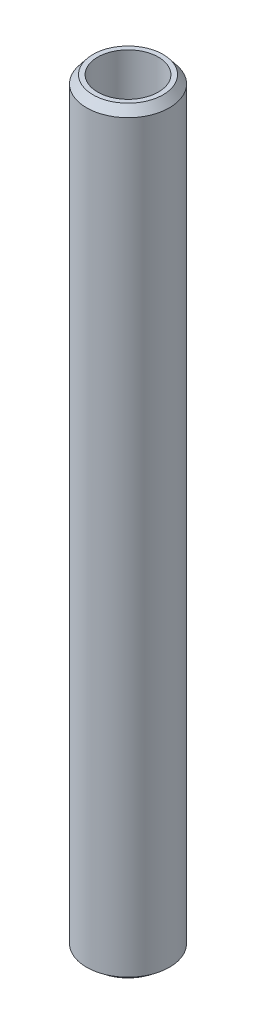
ISO-10303-21;
HEADER;
FILE_DESCRIPTION(('STEP AP214'),'2;1');
FILE_NAME('part.step','',(''),(''),'','','');
FILE_SCHEMA(('AUTOMOTIVE_DESIGN { 1 0 10303 214 1 1 1 1 }'));
ENDSEC;
DATA;
#1=APPLICATION_CONTEXT('core data for automotive mechanical design processes');
#2=APPLICATION_PROTOCOL_DEFINITION('international standard','automotive_design',2000,#1);
#3=PRODUCT_CONTEXT('',#1,'mechanical');
#4=PRODUCT('Part','Part','',(#3));
#5=PRODUCT_RELATED_PRODUCT_CATEGORY('part','',(#4));
#6=PRODUCT_DEFINITION_FORMATION('','',#4);
#7=PRODUCT_DEFINITION_CONTEXT('part definition',#1,'design');
#8=PRODUCT_DEFINITION('design','',#6,#7);
#9=PRODUCT_DEFINITION_SHAPE('','',#8);
#10=(LENGTH_UNIT() NAMED_UNIT(*) SI_UNIT(.MILLI.,.METRE.));
#11=(NAMED_UNIT(*) PLANE_ANGLE_UNIT() SI_UNIT($,.RADIAN.));
#12=(NAMED_UNIT(*) SI_UNIT($,.STERADIAN.) SOLID_ANGLE_UNIT());
#13=UNCERTAINTY_MEASURE_WITH_UNIT(LENGTH_MEASURE(1.E-05),#10,'distance_accuracy_value','');
#14=(GEOMETRIC_REPRESENTATION_CONTEXT(3) GLOBAL_UNCERTAINTY_ASSIGNED_CONTEXT((#13)) GLOBAL_UNIT_ASSIGNED_CONTEXT((#10,
#11,#12)) REPRESENTATION_CONTEXT('',''));
#15=CARTESIAN_POINT('',(0.,0.,0.));
#16=DIRECTION('',(0.,0.,1.));
#17=DIRECTION('',(1.,0.,0.));
#18=AXIS2_PLACEMENT_3D('',#15,#16,#17);
#19=CARTESIAN_POINT('',(0.,366.321487047811,0.));
#20=DIRECTION('',(0.,-1.,0.));
#21=DIRECTION('',(0.,0.,-1.));
#22=AXIS2_PLACEMENT_3D('',#19,#20,#21);
#23=CYLINDRICAL_SURFACE('',#22,20.);
#24=CARTESIAN_POINT('',(0.,362.430279607702,0.));
#25=DIRECTION('',(0.,1.,0.));
#26=DIRECTION('',(0.,0.,1.));
#27=AXIS2_PLACEMENT_3D('',#24,#25,#26);
#28=CIRCLE('',#27,20.);
#29=CARTESIAN_POINT('',(0.,362.430279607702,-20.));
#30=VERTEX_POINT('',#29);
#31=EDGE_CURVE('E50',#30,#30,#28,.F.);
#32=CARTESIAN_POINT('',(0.,3.08104572929319,0.));
#33=DIRECTION('',(0.,1.,0.));
#34=DIRECTION('',(0.,0.,1.));
#35=AXIS2_PLACEMENT_3D('',#32,#33,#34);
#36=CIRCLE('',#35,20.);
#37=CARTESIAN_POINT('',(0.,3.08104572929313,-20.));
#38=VERTEX_POINT('',#37);
#39=EDGE_CURVE('E51',#38,#38,#36,.T.);
#40=CARTESIAN_POINT('',(0.,362.430279607702,-20.));
#41=CARTESIAN_POINT('',(0.,358.687058421469,-20.));
#42=CARTESIAN_POINT('',(0.,354.943837235235,-20.));
#43=CARTESIAN_POINT('',(0.,347.457394862769,-20.));
#44=CARTESIAN_POINT('',(0.,343.714173676535,-20.));
#45=CARTESIAN_POINT('',(0.,336.227731304068,-20.));
#46=CARTESIAN_POINT('',(0.,332.484510117835,-20.));
#47=CARTESIAN_POINT('',(0.,324.998067745368,-20.));
#48=CARTESIAN_POINT('',(0.,321.254846559134,-20.));
#49=CARTESIAN_POINT('',(0.,313.768404186668,-20.));
#50=CARTESIAN_POINT('',(0.,310.025183000434,-20.));
#51=CARTESIAN_POINT('',(0.,302.538740627967,-20.));
#52=CARTESIAN_POINT('',(0.,298.795519441734,-20.));
#53=CARTESIAN_POINT('',(0.,291.309077069267,-20.));
#54=CARTESIAN_POINT('',(0.,287.565855883034,-20.));
#55=CARTESIAN_POINT('',(0.,280.079413510567,-20.));
#56=CARTESIAN_POINT('',(0.,276.336192324333,-20.));
#57=CARTESIAN_POINT('',(0.,268.849749951866,-20.));
#58=CARTESIAN_POINT('',(0.,265.106528765633,-20.));
#59=CARTESIAN_POINT('',(0.,257.620086393166,-20.));
#60=CARTESIAN_POINT('',(0.,253.876865206933,-20.));
#61=CARTESIAN_POINT('',(0.,246.390422834466,-20.));
#62=CARTESIAN_POINT('',(0.,242.647201648233,-20.));
#63=CARTESIAN_POINT('',(0.,235.160759275766,-20.));
#64=CARTESIAN_POINT('',(0.,231.417538089532,-20.));
#65=CARTESIAN_POINT('',(0.,223.931095717065,-20.));
#66=CARTESIAN_POINT('',(0.,220.187874530832,-20.));
#67=CARTESIAN_POINT('',(0.,212.701432158365,-20.));
#68=CARTESIAN_POINT('',(0.,208.958210972132,-20.));
#69=CARTESIAN_POINT('',(0.,201.471768599665,-20.));
#70=CARTESIAN_POINT('',(0.,197.728547413431,-20.));
#71=CARTESIAN_POINT('',(0.,190.242105040965,-20.));
#72=CARTESIAN_POINT('',(0.,186.498883854731,-20.));
#73=CARTESIAN_POINT('',(0.,179.012441482264,-20.));
#74=CARTESIAN_POINT('',(0.,175.269220296031,-20.));
#75=CARTESIAN_POINT('',(0.,167.782777923564,-20.));
#76=CARTESIAN_POINT('',(0.,164.039556737331,-20.));
#77=CARTESIAN_POINT('',(0.,156.553114364864,-20.));
#78=CARTESIAN_POINT('',(0.,152.80989317863,-20.));
#79=CARTESIAN_POINT('',(0.,145.323450806163,-20.));
#80=CARTESIAN_POINT('',(0.,141.58022961993,-20.));
#81=CARTESIAN_POINT('',(0.,134.093787247463,-20.));
#82=CARTESIAN_POINT('',(0.,130.35056606123,-20.));
#83=CARTESIAN_POINT('',(0.,122.864123688763,-20.));
#84=CARTESIAN_POINT('',(0.,119.120902502529,-20.));
#85=CARTESIAN_POINT('',(0.,111.634460130063,-20.));
#86=CARTESIAN_POINT('',(0.,107.891238943829,-20.));
#87=CARTESIAN_POINT('',(0.,100.404796571362,-20.));
#88=CARTESIAN_POINT('',(0.,96.6615753851288,-20.));
#89=CARTESIAN_POINT('',(0.,89.175133012662,-20.));
#90=CARTESIAN_POINT('',(0.,85.4319118264285,-20.));
#91=CARTESIAN_POINT('',(0.,77.9454694539617,-20.));
#92=CARTESIAN_POINT('',(0.,74.2022482677282,-20.));
#93=CARTESIAN_POINT('',(0.,66.7158058952613,-20.));
#94=CARTESIAN_POINT('',(0.,62.9725847090279,-20.));
#95=CARTESIAN_POINT('',(0.,55.4861423365611,-20.));
#96=CARTESIAN_POINT('',(0.,51.7429211503277,-20.));
#97=CARTESIAN_POINT('',(0.,44.2564787778608,-20.));
#98=CARTESIAN_POINT('',(0.,40.5132575916274,-20.));
#99=CARTESIAN_POINT('',(0.,33.0268152191605,-20.));
#100=CARTESIAN_POINT('',(0.,29.2835940329271,-20.));
#101=CARTESIAN_POINT('',(0.,21.7971516604602,-20.));
#102=CARTESIAN_POINT('',(0.,18.0539304742268,-20.));
#103=CARTESIAN_POINT('',(0.,10.56748810176,-20.));
#104=CARTESIAN_POINT('',(0.,6.82426691552655,-20.));
#105=CARTESIAN_POINT('',(0.,3.08104572929313,-20.));
#106=B_SPLINE_CURVE_WITH_KNOTS('',3,(#40,#41,#42,#43,#44,#45,#46,#47,#48,#49,#50,#51,#52,#53,
#54,#55,#56,#57,#58,#59,#60,#61,#62,#63,#64,#65,#66,#67,#68,#69,#70,#71,#72,#73,#74,#75,#76,#77,
#78,#79,#80,#81,#82,#83,#84,#85,#86,#87,#88,#89,#90,#91,#92,#93,#94,#95,#96,#97,#98,#99,#100,
#101,#102,#103,#104,#105),.UNSPECIFIED.,.F.,.F.,(4,2,2,2,2,2,2,2,2,2,2,2,2,2,2,2,2,2,2,2,2,2,2,
2,2,2,2,2,2,2,2,2,4),(0.,11.2296635587003,22.4593271174006,33.6889906761009,44.9186542348012,
56.1483177935014,67.3779813522017,78.607644910902,89.8373084696023,101.066972028303,
112.296635587003,123.526299145703,134.755962704403,145.985626263104,157.215289821804,
168.444953380504,179.674616939205,190.904280497905,202.133944056605,213.363607615305,
224.593271174006,235.822934732706,247.052598291406,258.282261850107,269.511925408807,
280.741588967507,291.971252526207,303.200916084908,314.430579643608,325.660243202308,
336.889906761009,348.119570319709,359.349233878409),.UNSPECIFIED.);
#107=EDGE_CURVE('BSEAM39',#30,#38,#106,.T.);
#108=ORIENTED_EDGE('',*,*,#31,.T.);
#109=ORIENTED_EDGE('',*,*,#39,.T.);
#110=ORIENTED_EDGE('',*,*,#107,.T.);
#111=ORIENTED_EDGE('',*,*,#107,.F.);
#112=EDGE_LOOP('',(#108,#110,#109,#111));
#113=FACE_BOUND('',#112,.T.);
#114=ADVANCED_FACE('F39',(#113),#23,.T.);
#115=CARTESIAN_POINT('',(0.,366.321487047811,0.));
#116=DIRECTION('',(0.,1.,0.));
#117=DIRECTION('',(0.,0.,1.));
#118=AXIS2_PLACEMENT_3D('',#115,#116,#117);
#119=PLANE('',#118);
#120=CARTESIAN_POINT('',(0.,366.321487047811,0.));
#121=DIRECTION('',(0.,1.,0.));
#122=DIRECTION('',(0.,0.,1.));
#123=AXIS2_PLACEMENT_3D('',#120,#121,#122);
#124=CIRCLE('',#123,16.9189542707068);
#125=CARTESIAN_POINT('',(0.,366.321487047811,-16.9189542707069));
#126=VERTEX_POINT('',#125);
#127=EDGE_CURVE('E54',#126,#126,#124,.T.);
#128=ORIENTED_EDGE('',*,*,#127,.T.);
#129=EDGE_LOOP('',(#128));
#130=FACE_BOUND('',#129,.T.);
#131=CARTESIAN_POINT('',(0.,366.321487047811,0.));
#132=DIRECTION('',(0.,1.,0.));
#133=DIRECTION('',(0.,0.,1.));
#134=AXIS2_PLACEMENT_3D('',#131,#132,#133);
#135=CIRCLE('',#134,14.653156494735);
#136=CARTESIAN_POINT('',(0.,366.321487047811,14.653156494735));
#137=VERTEX_POINT('',#136);
#138=EDGE_CURVE('E58',#137,#137,#135,.T.);
#139=ORIENTED_EDGE('',*,*,#138,.F.);
#140=EDGE_LOOP('',(#139));
#141=FACE_BOUND('',#140,.T.);
#142=ADVANCED_FACE('F69',(#130,#141),#119,.T.);
#143=CARTESIAN_POINT('',(0.,0.,0.));
#144=DIRECTION('',(0.,1.,0.));
#145=DIRECTION('',(0.,0.,1.));
#146=AXIS2_PLACEMENT_3D('',#143,#144,#145);
#147=PLANE('',#146);
#148=CARTESIAN_POINT('',(0.,0.,0.));
#149=DIRECTION('',(0.,1.,0.));
#150=DIRECTION('',(0.,0.,1.));
#151=AXIS2_PLACEMENT_3D('',#148,#149,#150);
#152=CIRCLE('',#151,16.1087925598911);
#153=CARTESIAN_POINT('',(0.,0.,16.1087925598911));
#154=VERTEX_POINT('',#153);
#155=EDGE_CURVE('E10',#154,#154,#152,.F.);
#156=ORIENTED_EDGE('',*,*,#155,.T.);
#157=EDGE_LOOP('',(#156));
#158=FACE_BOUND('',#157,.T.);
#159=CARTESIAN_POINT('',(0.,0.,0.));
#160=DIRECTION('',(0.,1.,0.));
#161=DIRECTION('',(0.,0.,1.));
#162=AXIS2_PLACEMENT_3D('',#159,#160,#161);
#163=CIRCLE('',#162,14.653156494735);
#164=CARTESIAN_POINT('',(0.,0.,14.653156494735));
#165=VERTEX_POINT('',#164);
#166=EDGE_CURVE('E63',#165,#165,#163,.T.);
#167=ORIENTED_EDGE('',*,*,#166,.T.);
#168=EDGE_LOOP('',(#167));
#169=FACE_BOUND('',#168,.T.);
#170=ADVANCED_FACE('F75',(#158,#169),#147,.F.);
#171=CARTESIAN_POINT('',(0.,366.321487047811,0.));
#172=DIRECTION('',(0.,-1.,0.));
#173=DIRECTION('',(0.,0.,-1.));
#174=AXIS2_PLACEMENT_3D('',#171,#172,#173);
#175=CYLINDRICAL_SURFACE('',#174,14.653156494735);
#176=ORIENTED_EDGE('',*,*,#138,.T.);
#177=EDGE_LOOP('',(#176));
#178=FACE_BOUND('',#177,.T.);
#179=ORIENTED_EDGE('',*,*,#166,.F.);
#180=EDGE_LOOP('',(#179));
#181=FACE_BOUND('',#180,.T.);
#182=ADVANCED_FACE('F70',(#178,#181),#175,.F.);
#183=CARTESIAN_POINT('',(0.,366.321487047811,0.));
#184=DIRECTION('',(0.,-1.,0.));
#185=DIRECTION('',(0.,0.,-1.));
#186=AXIS2_PLACEMENT_3D('',#183,#184,#185);
#187=CONICAL_SURFACE('',#186,16.9189542707068,0.669718957742459);
#188=CARTESIAN_POINT('',(0.,362.430279607702,-20.));
#189=CARTESIAN_POINT('',(0.,362.470813018537,-19.9679057736532));
#190=CARTESIAN_POINT('',(0.,362.511346429371,-19.9358115473064));
#191=CARTESIAN_POINT('',(0.,362.59241325104,-19.8716230946128));
#192=CARTESIAN_POINT('',(0.,362.632946661874,-19.839528868266));
#193=CARTESIAN_POINT('',(0.,362.714013483544,-19.7753404155724));
#194=CARTESIAN_POINT('',(0.,362.754546894378,-19.7432461892256));
#195=CARTESIAN_POINT('',(0.,362.835613716047,-19.679057736532));
#196=CARTESIAN_POINT('',(0.,362.876147126881,-19.6469635101852));
#197=CARTESIAN_POINT('',(0.,362.95721394855,-19.5827750574916));
#198=CARTESIAN_POINT('',(0.,362.997747359385,-19.5506808311448));
#199=CARTESIAN_POINT('',(0.,363.078814181054,-19.4864923784512));
#200=CARTESIAN_POINT('',(0.,363.119347591888,-19.4543981521044));
#201=CARTESIAN_POINT('',(0.,363.200414413557,-19.3902096994108));
#202=CARTESIAN_POINT('',(0.,363.240947824392,-19.3581154730639));
#203=CARTESIAN_POINT('',(0.,363.32201464606,-19.2939270203703));
#204=CARTESIAN_POINT('',(0.,363.362548056895,-19.2618327940235));
#205=CARTESIAN_POINT('',(0.,363.443614878564,-19.1976443413299));
#206=CARTESIAN_POINT('',(0.,363.484148289398,-19.1655501149831));
#207=CARTESIAN_POINT('',(0.,363.565215111067,-19.1013616622895));
#208=CARTESIAN_POINT('',(0.,363.605748521902,-19.0692674359427));
#209=CARTESIAN_POINT('',(0.,363.686815343571,-19.0050789832491));
#210=CARTESIAN_POINT('',(0.,363.727348754405,-18.9729847569023));
#211=CARTESIAN_POINT('',(0.,363.808415576074,-18.9087963042087));
#212=CARTESIAN_POINT('',(0.,363.848948986909,-18.8767020778619));
#213=CARTESIAN_POINT('',(0.,363.930015808578,-18.8125136251683));
#214=CARTESIAN_POINT('',(0.,363.970549219412,-18.7804193988215));
#215=CARTESIAN_POINT('',(0.,364.051616041081,-18.7162309461279));
#216=CARTESIAN_POINT('',(0.,364.092149451915,-18.6841367197811));
#217=CARTESIAN_POINT('',(0.,364.173216273584,-18.6199482670875));
#218=CARTESIAN_POINT('',(0.,364.213749684419,-18.5878540407407));
#219=CARTESIAN_POINT('',(0.,364.294816506088,-18.523665588047));
#220=CARTESIAN_POINT('',(0.,364.335349916922,-18.4915713617002));
#221=CARTESIAN_POINT('',(0.,364.416416738591,-18.4273829090066));
#222=CARTESIAN_POINT('',(0.,364.456950149426,-18.3952886826598));
#223=CARTESIAN_POINT('',(0.,364.538016971095,-18.3311002299662));
#224=CARTESIAN_POINT('',(0.,364.578550381929,-18.2990060036194));
#225=CARTESIAN_POINT('',(0.,364.659617203598,-18.2348175509258));
#226=CARTESIAN_POINT('',(0.,364.700150614432,-18.202723324579));
#227=CARTESIAN_POINT('',(0.,364.781217436101,-18.1385348718854));
#228=CARTESIAN_POINT('',(0.,364.821750846936,-18.1064406455386));
#229=CARTESIAN_POINT('',(0.,364.902817668605,-18.042252192845));
#230=CARTESIAN_POINT('',(0.,364.943351079439,-18.0101579664982));
#231=CARTESIAN_POINT('',(0.,365.024417901108,-17.9459695138046));
#232=CARTESIAN_POINT('',(0.,365.064951311943,-17.9138752874578));
#233=CARTESIAN_POINT('',(0.,365.146018133612,-17.8496868347642));
#234=CARTESIAN_POINT('',(0.,365.186551544446,-17.8175926084174));
#235=CARTESIAN_POINT('',(0.,365.267618366115,-17.7534041557238));
#236=CARTESIAN_POINT('',(0.,365.30815177695,-17.721309929377));
#237=CARTESIAN_POINT('',(0.,365.389218598618,-17.6571214766833));
#238=CARTESIAN_POINT('',(0.,365.429752009453,-17.6250272503365));
#239=CARTESIAN_POINT('',(0.,365.510818831122,-17.5608387976429));
#240=CARTESIAN_POINT('',(0.,365.551352241956,-17.5287445712961));
#241=CARTESIAN_POINT('',(0.,365.632419063625,-17.4645561186025));
#242=CARTESIAN_POINT('',(0.,365.67295247446,-17.4324618922557));
#243=CARTESIAN_POINT('',(0.,365.754019296129,-17.3682734395621));
#244=CARTESIAN_POINT('',(0.,365.794552706963,-17.3361792132153));
#245=CARTESIAN_POINT('',(0.,365.875619528632,-17.2719907605217));
#246=CARTESIAN_POINT('',(0.,365.916152939466,-17.2398965341749));
#247=CARTESIAN_POINT('',(0.,365.997219761135,-17.1757080814813));
#248=CARTESIAN_POINT('',(0.,366.03775317197,-17.1436138551345));
#249=CARTESIAN_POINT('',(0.,366.118819993639,-17.0794254024409));
#250=CARTESIAN_POINT('',(0.,366.159353404473,-17.0473311760941));
#251=CARTESIAN_POINT('',(0.,366.240420226142,-16.9831427234005));
#252=CARTESIAN_POINT('',(0.,366.280953636977,-16.9510484970537));
#253=CARTESIAN_POINT('',(0.,366.321487047811,-16.9189542707069));
#254=B_SPLINE_CURVE_WITH_KNOTS('',3,(#188,#189,#190,#191,#192,#193,#194,#195,#196,#197,#198,
#199,#200,#201,#202,#203,#204,#205,#206,#207,#208,#209,#210,#211,#212,#213,#214,#215,#216,#217,
#218,#219,#220,#221,#222,#223,#224,#225,#226,#227,#228,#229,#230,#231,#232,#233,#234,#235,#236,
#237,#238,#239,#240,#241,#242,#243,#244,#245,#246,#247,#248,#249,#250,#251,#252,#253),
.UNSPECIFIED.,.F.,.F.,(4,2,2,2,2,2,2,2,2,2,2,2,2,2,2,2,2,2,2,2,2,2,2,2,2,2,2,2,2,2,2,2,4),(0.,
0.155103097416143,0.310206194832283,0.465309292248426,0.620412389664567,0.775515487080707,
0.930618584496848,1.08572168191299,1.24082477932913,1.39592787674527,1.55103097416141,
1.70613407157756,1.86123716899374,2.01634026640988,2.17144336382602,2.32654646124217,
2.48164955865826,2.6367526560744,2.79185575349055,2.94695885090669,3.10206194832283,
3.25716504573897,3.41226814315511,3.56737124057125,3.72247433798744,3.87757743540358,
4.03268053281972,4.18778363023586,4.342886727652,4.49798982506814,4.65309292248428,
4.80819601990043,4.96329911731657),.UNSPECIFIED.);
#255=EDGE_CURVE('BSEAM81',#30,#126,#254,.T.);
#256=ORIENTED_EDGE('',*,*,#31,.F.);
#257=ORIENTED_EDGE('',*,*,#127,.F.);
#258=ORIENTED_EDGE('',*,*,#255,.T.);
#259=ORIENTED_EDGE('',*,*,#255,.F.);
#260=EDGE_LOOP('',(#256,#258,#257,#259));
#261=FACE_BOUND('',#260,.T.);
#262=ADVANCED_FACE('F81',(#261),#187,.T.);
#263=CARTESIAN_POINT('',(0.,3.08104572929319,0.));
#264=DIRECTION('',(0.,1.,0.));
#265=DIRECTION('',(0.,0.,1.));
#266=AXIS2_PLACEMENT_3D('',#263,#264,#265);
#267=CONICAL_SURFACE('',#266,20.,0.901077369052432);
#268=ORIENTED_EDGE('',*,*,#155,.F.);
#269=EDGE_LOOP('',(#268));
#270=FACE_BOUND('',#269,.T.);
#271=ORIENTED_EDGE('',*,*,#39,.F.);
#272=EDGE_LOOP('',(#271));
#273=FACE_BOUND('',#272,.T.);
#274=ADVANCED_FACE('F45',(#270,#273),#267,.T.);
#275=CLOSED_SHELL('',(#114,#142,#170,#182,#262,#274));
#276=MANIFOLD_SOLID_BREP('B2',#275);
#277=ADVANCED_BREP_SHAPE_REPRESENTATION('',(#18,#276),#14);
#278=SHAPE_DEFINITION_REPRESENTATION(#9,#277);
ENDSEC;
END-ISO-10303-21;
